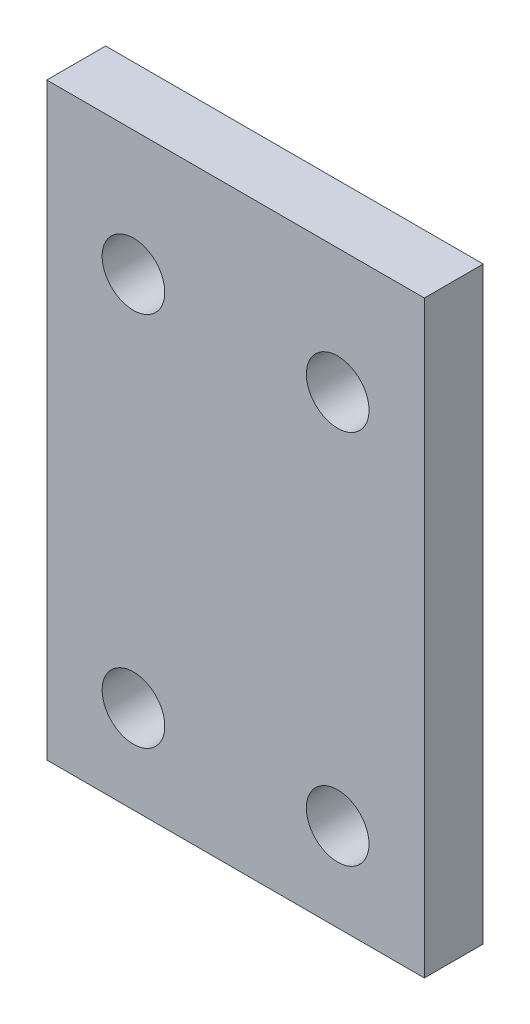
ISO-10303-21;
HEADER;
FILE_DESCRIPTION(('STEP AP214'),'2;1');
FILE_NAME('part.step','',(''),(''),'','','');
FILE_SCHEMA(('AUTOMOTIVE_DESIGN { 1 0 10303 214 1 1 1 1 }'));
ENDSEC;
DATA;
#1=APPLICATION_CONTEXT('core data for automotive mechanical design processes');
#2=APPLICATION_PROTOCOL_DEFINITION('international standard','automotive_design',2000,#1);
#3=PRODUCT_CONTEXT('',#1,'mechanical');
#4=PRODUCT('Part','Part','',(#3));
#5=PRODUCT_RELATED_PRODUCT_CATEGORY('part','',(#4));
#6=PRODUCT_DEFINITION_FORMATION('','',#4);
#7=PRODUCT_DEFINITION_CONTEXT('part definition',#1,'design');
#8=PRODUCT_DEFINITION('design','',#6,#7);
#9=PRODUCT_DEFINITION_SHAPE('','',#8);
#10=(LENGTH_UNIT() NAMED_UNIT(*) SI_UNIT(.MILLI.,.METRE.));
#11=(NAMED_UNIT(*) PLANE_ANGLE_UNIT() SI_UNIT($,.RADIAN.));
#12=(NAMED_UNIT(*) SI_UNIT($,.STERADIAN.) SOLID_ANGLE_UNIT());
#13=UNCERTAINTY_MEASURE_WITH_UNIT(LENGTH_MEASURE(1.E-05),#10,'distance_accuracy_value','');
#14=(GEOMETRIC_REPRESENTATION_CONTEXT(3) GLOBAL_UNCERTAINTY_ASSIGNED_CONTEXT((#13)) GLOBAL_UNIT_ASSIGNED_CONTEXT((#10,
#11,#12)) REPRESENTATION_CONTEXT('',''));
#15=CARTESIAN_POINT('',(0.,0.,0.));
#16=DIRECTION('',(0.,0.,1.));
#17=DIRECTION('',(1.,0.,0.));
#18=AXIS2_PLACEMENT_3D('',#15,#16,#17);
#19=CARTESIAN_POINT('',(20.3581,31.75,6.35));
#20=DIRECTION('',(0.,0.,-1.));
#21=DIRECTION('',(-1.,0.,0.));
#22=AXIS2_PLACEMENT_3D('',#19,#20,#21);
#23=PLANE('',#22);
#24=CARTESIAN_POINT('',(-11.0109,-22.225,6.35));
#25=DIRECTION('',(0.,0.,1.));
#26=DIRECTION('',(-1.,0.,0.));
#27=AXIS2_PLACEMENT_3D('',#24,#25,#26);
#28=CIRCLE('',#27,3.37819999999999);
#29=CARTESIAN_POINT('',(-14.3891,-22.225,6.35));
#30=VERTEX_POINT('',#29);
#31=EDGE_CURVE('E120',#30,#30,#28,.T.);
#32=ORIENTED_EDGE('',*,*,#31,.F.);
#33=EDGE_LOOP('',(#32));
#34=FACE_BOUND('',#33,.T.);
#35=CARTESIAN_POINT('',(11.0109,18.288,6.35));
#36=DIRECTION('',(0.,0.,1.));
#37=DIRECTION('',(1.,0.,0.));
#38=AXIS2_PLACEMENT_3D('',#35,#36,#37);
#39=CIRCLE('',#38,3.37819999999999);
#40=CARTESIAN_POINT('',(14.3891,18.288,6.35));
#41=VERTEX_POINT('',#40);
#42=EDGE_CURVE('E99',#41,#41,#39,.T.);
#43=ORIENTED_EDGE('',*,*,#42,.F.);
#44=EDGE_LOOP('',(#43));
#45=FACE_BOUND('',#44,.T.);
#46=DIRECTION('',(0.,1.,0.));
#47=VECTOR('',#46,1.);
#48=CARTESIAN_POINT('',(20.3581,-31.75,6.35));
#49=LINE('',#48,#47);
#50=CARTESIAN_POINT('',(20.3581,-31.75,6.35));
#51=VERTEX_POINT('',#50);
#52=CARTESIAN_POINT('',(20.3581,31.75,6.35));
#53=VERTEX_POINT('',#52);
#54=EDGE_CURVE('E84',#51,#53,#49,.T.);
#55=ORIENTED_EDGE('',*,*,#54,.T.);
#56=DIRECTION('',(-1.,0.,0.));
#57=VECTOR('',#56,1.);
#58=CARTESIAN_POINT('',(-20.3581,31.75,6.35));
#59=LINE('',#58,#57);
#60=CARTESIAN_POINT('',(-20.3581,31.75,6.35));
#61=VERTEX_POINT('',#60);
#62=EDGE_CURVE('E79',#53,#61,#59,.T.);
#63=ORIENTED_EDGE('',*,*,#62,.T.);
#64=DIRECTION('',(0.,-1.,0.));
#65=VECTOR('',#64,1.);
#66=CARTESIAN_POINT('',(-20.3581,-31.75,6.35));
#67=LINE('',#66,#65);
#68=CARTESIAN_POINT('',(-20.3581,-31.75,6.35));
#69=VERTEX_POINT('',#68);
#70=EDGE_CURVE('E82',#61,#69,#67,.T.);
#71=ORIENTED_EDGE('',*,*,#70,.T.);
#72=DIRECTION('',(1.,0.,0.));
#73=VECTOR('',#72,1.);
#74=CARTESIAN_POINT('',(-20.3581,-31.75,6.35));
#75=LINE('',#74,#73);
#76=EDGE_CURVE('E49',#69,#51,#75,.T.);
#77=ORIENTED_EDGE('',*,*,#76,.T.);
#78=EDGE_LOOP('',(#55,#63,#71,#77));
#79=FACE_BOUND('',#78,.T.);
#80=CARTESIAN_POINT('',(11.0109,-22.225,6.35));
#81=DIRECTION('',(0.,0.,1.));
#82=DIRECTION('',(1.,0.,0.));
#83=AXIS2_PLACEMENT_3D('',#80,#81,#82);
#84=CIRCLE('',#83,3.37819999999999);
#85=CARTESIAN_POINT('',(14.3891,-22.225,6.35));
#86=VERTEX_POINT('',#85);
#87=EDGE_CURVE('E114',#86,#86,#84,.T.);
#88=ORIENTED_EDGE('',*,*,#87,.F.);
#89=EDGE_LOOP('',(#88));
#90=FACE_BOUND('',#89,.T.);
#91=CARTESIAN_POINT('',(-11.0109,18.288,6.35));
#92=DIRECTION('',(0.,0.,1.));
#93=DIRECTION('',(-1.,0.,0.));
#94=AXIS2_PLACEMENT_3D('',#91,#92,#93);
#95=CIRCLE('',#94,3.37820000000001);
#96=CARTESIAN_POINT('',(-14.3891,18.288,6.35));
#97=VERTEX_POINT('',#96);
#98=EDGE_CURVE('E126',#97,#97,#95,.T.);
#99=ORIENTED_EDGE('',*,*,#98,.F.);
#100=EDGE_LOOP('',(#99));
#101=FACE_BOUND('',#100,.T.);
#102=ADVANCED_FACE('F32',(#34,#45,#79,#90,#101),#23,.F.);
#103=CARTESIAN_POINT('',(20.3581,31.75,0.));
#104=DIRECTION('',(0.,0.,-1.));
#105=DIRECTION('',(-1.,0.,0.));
#106=AXIS2_PLACEMENT_3D('',#103,#104,#105);
#107=PLANE('',#106);
#108=CARTESIAN_POINT('',(-11.0109,-22.225,0.));
#109=DIRECTION('',(0.,0.,1.));
#110=DIRECTION('',(-1.,0.,0.));
#111=AXIS2_PLACEMENT_3D('',#108,#109,#110);
#112=CIRCLE('',#111,3.37819999999999);
#113=CARTESIAN_POINT('',(-14.3891,-22.225,0.));
#114=VERTEX_POINT('',#113);
#115=EDGE_CURVE('E123',#114,#114,#112,.T.);
#116=ORIENTED_EDGE('',*,*,#115,.T.);
#117=EDGE_LOOP('',(#116));
#118=FACE_BOUND('',#117,.T.);
#119=CARTESIAN_POINT('',(11.0109,18.288,0.));
#120=DIRECTION('',(0.,0.,1.));
#121=DIRECTION('',(1.,0.,0.));
#122=AXIS2_PLACEMENT_3D('',#119,#120,#121);
#123=CIRCLE('',#122,3.37819999999999);
#124=CARTESIAN_POINT('',(14.3891,18.288,0.));
#125=VERTEX_POINT('',#124);
#126=EDGE_CURVE('E111',#125,#125,#123,.T.);
#127=ORIENTED_EDGE('',*,*,#126,.T.);
#128=EDGE_LOOP('',(#127));
#129=FACE_BOUND('',#128,.T.);
#130=DIRECTION('',(0.,1.,0.));
#131=VECTOR('',#130,1.);
#132=CARTESIAN_POINT('',(20.3581,-31.75,0.));
#133=LINE('',#132,#131);
#134=CARTESIAN_POINT('',(20.3581,-31.75,0.));
#135=VERTEX_POINT('',#134);
#136=CARTESIAN_POINT('',(20.3581,31.75,0.));
#137=VERTEX_POINT('',#136);
#138=EDGE_CURVE('E96',#135,#137,#133,.T.);
#139=ORIENTED_EDGE('',*,*,#138,.F.);
#140=DIRECTION('',(1.,0.,0.));
#141=VECTOR('',#140,1.);
#142=CARTESIAN_POINT('',(-20.3581,-31.75,0.));
#143=LINE('',#142,#141);
#144=CARTESIAN_POINT('',(-20.3581,-31.75,0.));
#145=VERTEX_POINT('',#144);
#146=EDGE_CURVE('E72',#145,#135,#143,.T.);
#147=ORIENTED_EDGE('',*,*,#146,.F.);
#148=DIRECTION('',(0.,-1.,0.));
#149=VECTOR('',#148,1.);
#150=CARTESIAN_POINT('',(-20.3581,-31.75,0.));
#151=LINE('',#150,#149);
#152=CARTESIAN_POINT('',(-20.3581,31.75,0.));
#153=VERTEX_POINT('',#152);
#154=EDGE_CURVE('E66',#153,#145,#151,.T.);
#155=ORIENTED_EDGE('',*,*,#154,.F.);
#156=DIRECTION('',(-1.,0.,0.));
#157=VECTOR('',#156,1.);
#158=CARTESIAN_POINT('',(-20.3581,31.75,0.));
#159=LINE('',#158,#157);
#160=EDGE_CURVE('E88',#137,#153,#159,.T.);
#161=ORIENTED_EDGE('',*,*,#160,.F.);
#162=EDGE_LOOP('',(#139,#147,#155,#161));
#163=FACE_BOUND('',#162,.T.);
#164=CARTESIAN_POINT('',(11.0109,-22.225,0.));
#165=DIRECTION('',(0.,0.,1.));
#166=DIRECTION('',(1.,0.,0.));
#167=AXIS2_PLACEMENT_3D('',#164,#165,#166);
#168=CIRCLE('',#167,3.37819999999999);
#169=CARTESIAN_POINT('',(14.3891,-22.225,0.));
#170=VERTEX_POINT('',#169);
#171=EDGE_CURVE('E117',#170,#170,#168,.T.);
#172=ORIENTED_EDGE('',*,*,#171,.T.);
#173=EDGE_LOOP('',(#172));
#174=FACE_BOUND('',#173,.T.);
#175=CARTESIAN_POINT('',(-11.0109,18.288,0.));
#176=DIRECTION('',(0.,0.,1.));
#177=DIRECTION('',(-1.,0.,0.));
#178=AXIS2_PLACEMENT_3D('',#175,#176,#177);
#179=CIRCLE('',#178,3.37820000000001);
#180=CARTESIAN_POINT('',(-14.3891,18.288,0.));
#181=VERTEX_POINT('',#180);
#182=EDGE_CURVE('E129',#181,#181,#179,.T.);
#183=ORIENTED_EDGE('',*,*,#182,.T.);
#184=EDGE_LOOP('',(#183));
#185=FACE_BOUND('',#184,.T.);
#186=ADVANCED_FACE('F107',(#118,#129,#163,#174,#185),#107,.T.);
#187=CARTESIAN_POINT('',(20.3581,-31.75,6.35));
#188=DIRECTION('',(-1.,0.,0.));
#189=DIRECTION('',(0.,0.,1.));
#190=AXIS2_PLACEMENT_3D('',#187,#188,#189);
#191=PLANE('',#190);
#192=ORIENTED_EDGE('',*,*,#138,.T.);
#193=DIRECTION('',(0.,0.,-1.));
#194=VECTOR('',#193,1.);
#195=CARTESIAN_POINT('',(20.3581,31.75,6.35));
#196=LINE('',#195,#194);
#197=EDGE_CURVE('E11',#53,#137,#196,.T.);
#198=ORIENTED_EDGE('',*,*,#197,.F.);
#199=ORIENTED_EDGE('',*,*,#54,.F.);
#200=DIRECTION('',(0.,0.,-1.));
#201=VECTOR('',#200,1.);
#202=CARTESIAN_POINT('',(20.3581,-31.75,6.35));
#203=LINE('',#202,#201);
#204=EDGE_CURVE('E92',#51,#135,#203,.T.);
#205=ORIENTED_EDGE('',*,*,#204,.T.);
#206=EDGE_LOOP('',(#192,#198,#199,#205));
#207=FACE_BOUND('',#206,.T.);
#208=ADVANCED_FACE('F34',(#207),#191,.F.);
#209=CARTESIAN_POINT('',(-20.3581,31.75,6.35));
#210=DIRECTION('',(0.,-1.,0.));
#211=DIRECTION('',(1.,0.,0.));
#212=AXIS2_PLACEMENT_3D('',#209,#210,#211);
#213=PLANE('',#212);
#214=ORIENTED_EDGE('',*,*,#160,.T.);
#215=DIRECTION('',(0.,0.,-1.));
#216=VECTOR('',#215,1.);
#217=CARTESIAN_POINT('',(-20.3581,31.75,6.35));
#218=LINE('',#217,#216);
#219=EDGE_CURVE('E41',#61,#153,#218,.T.);
#220=ORIENTED_EDGE('',*,*,#219,.F.);
#221=ORIENTED_EDGE('',*,*,#62,.F.);
#222=ORIENTED_EDGE('',*,*,#197,.T.);
#223=EDGE_LOOP('',(#214,#220,#221,#222));
#224=FACE_BOUND('',#223,.T.);
#225=ADVANCED_FACE('F87',(#224),#213,.F.);
#226=CARTESIAN_POINT('',(-20.3581,-31.75,6.35));
#227=DIRECTION('',(1.,0.,0.));
#228=DIRECTION('',(0.,0.,-1.));
#229=AXIS2_PLACEMENT_3D('',#226,#227,#228);
#230=PLANE('',#229);
#231=ORIENTED_EDGE('',*,*,#154,.T.);
#232=DIRECTION('',(0.,0.,-1.));
#233=VECTOR('',#232,1.);
#234=CARTESIAN_POINT('',(-20.3581,-31.75,6.35));
#235=LINE('',#234,#233);
#236=EDGE_CURVE('E89',#69,#145,#235,.T.);
#237=ORIENTED_EDGE('',*,*,#236,.F.);
#238=ORIENTED_EDGE('',*,*,#70,.F.);
#239=ORIENTED_EDGE('',*,*,#219,.T.);
#240=EDGE_LOOP('',(#231,#237,#238,#239));
#241=FACE_BOUND('',#240,.T.);
#242=ADVANCED_FACE('F90',(#241),#230,.F.);
#243=CARTESIAN_POINT('',(-20.3581,-31.75,6.35));
#244=DIRECTION('',(0.,1.,0.));
#245=DIRECTION('',(0.,0.,1.));
#246=AXIS2_PLACEMENT_3D('',#243,#244,#245);
#247=PLANE('',#246);
#248=ORIENTED_EDGE('',*,*,#146,.T.);
#249=ORIENTED_EDGE('',*,*,#204,.F.);
#250=ORIENTED_EDGE('',*,*,#76,.F.);
#251=ORIENTED_EDGE('',*,*,#236,.T.);
#252=EDGE_LOOP('',(#248,#249,#250,#251));
#253=FACE_BOUND('',#252,.T.);
#254=ADVANCED_FACE('F104',(#253),#247,.F.);
#255=CARTESIAN_POINT('',(11.0109,18.288,6.35));
#256=DIRECTION('',(0.,0.,-1.));
#257=DIRECTION('',(-1.,0.,0.));
#258=AXIS2_PLACEMENT_3D('',#255,#256,#257);
#259=CYLINDRICAL_SURFACE('',#258,3.37819999999999);
#260=ORIENTED_EDGE('',*,*,#42,.T.);
#261=EDGE_LOOP('',(#260));
#262=FACE_BOUND('',#261,.T.);
#263=ORIENTED_EDGE('',*,*,#126,.F.);
#264=EDGE_LOOP('',(#263));
#265=FACE_BOUND('',#264,.T.);
#266=ADVANCED_FACE('F149',(#262,#265),#259,.F.);
#267=CARTESIAN_POINT('',(11.0109,-22.225,6.35));
#268=DIRECTION('',(0.,0.,-1.));
#269=DIRECTION('',(-1.,0.,0.));
#270=AXIS2_PLACEMENT_3D('',#267,#268,#269);
#271=CYLINDRICAL_SURFACE('',#270,3.37819999999999);
#272=ORIENTED_EDGE('',*,*,#87,.T.);
#273=EDGE_LOOP('',(#272));
#274=FACE_BOUND('',#273,.T.);
#275=ORIENTED_EDGE('',*,*,#171,.F.);
#276=EDGE_LOOP('',(#275));
#277=FACE_BOUND('',#276,.T.);
#278=ADVANCED_FACE('F195',(#274,#277),#271,.F.);
#279=CARTESIAN_POINT('',(-11.0109,-22.225,6.35));
#280=DIRECTION('',(0.,0.,-1.));
#281=DIRECTION('',(-1.,0.,0.));
#282=AXIS2_PLACEMENT_3D('',#279,#280,#281);
#283=CYLINDRICAL_SURFACE('',#282,3.37819999999999);
#284=ORIENTED_EDGE('',*,*,#31,.T.);
#285=EDGE_LOOP('',(#284));
#286=FACE_BOUND('',#285,.T.);
#287=ORIENTED_EDGE('',*,*,#115,.F.);
#288=EDGE_LOOP('',(#287));
#289=FACE_BOUND('',#288,.T.);
#290=ADVANCED_FACE('F203',(#286,#289),#283,.F.);
#291=CARTESIAN_POINT('',(-11.0109,18.288,6.35));
#292=DIRECTION('',(0.,0.,-1.));
#293=DIRECTION('',(-1.,0.,0.));
#294=AXIS2_PLACEMENT_3D('',#291,#292,#293);
#295=CYLINDRICAL_SURFACE('',#294,3.37820000000001);
#296=ORIENTED_EDGE('',*,*,#98,.T.);
#297=EDGE_LOOP('',(#296));
#298=FACE_BOUND('',#297,.T.);
#299=ORIENTED_EDGE('',*,*,#182,.F.);
#300=EDGE_LOOP('',(#299));
#301=FACE_BOUND('',#300,.T.);
#302=ADVANCED_FACE('F135',(#298,#301),#295,.F.);
#303=CLOSED_SHELL('',(#102,#186,#208,#225,#242,#254,#266,#278,#290,#302));
#304=MANIFOLD_SOLID_BREP('B2',#303);
#305=ADVANCED_BREP_SHAPE_REPRESENTATION('',(#18,#304),#14);
#306=SHAPE_DEFINITION_REPRESENTATION(#9,#305);
ENDSEC;
END-ISO-10303-21;
